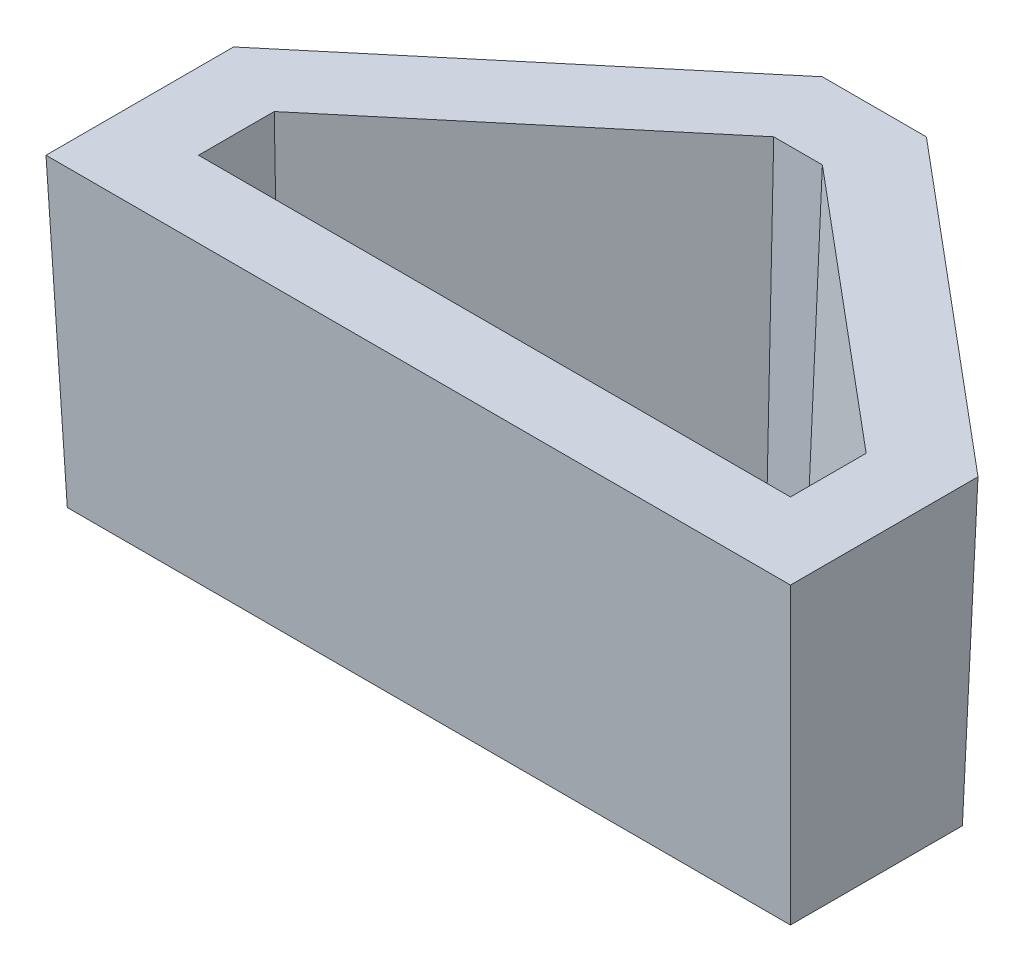
ISO-10303-21;
HEADER;
FILE_DESCRIPTION(('STEP AP214'),'2;1');
FILE_NAME('part.step','',(''),(''),'','','');
FILE_SCHEMA(('AUTOMOTIVE_DESIGN { 1 0 10303 214 1 1 1 1 }'));
ENDSEC;
DATA;
#1=APPLICATION_CONTEXT('core data for automotive mechanical design processes');
#2=APPLICATION_PROTOCOL_DEFINITION('international standard','automotive_design',2000,#1);
#3=PRODUCT_CONTEXT('',#1,'mechanical');
#4=PRODUCT('Part','Part','',(#3));
#5=PRODUCT_RELATED_PRODUCT_CATEGORY('part','',(#4));
#6=PRODUCT_DEFINITION_FORMATION('','',#4);
#7=PRODUCT_DEFINITION_CONTEXT('part definition',#1,'design');
#8=PRODUCT_DEFINITION('design','',#6,#7);
#9=PRODUCT_DEFINITION_SHAPE('','',#8);
#10=(LENGTH_UNIT() NAMED_UNIT(*) SI_UNIT(.MILLI.,.METRE.));
#11=(NAMED_UNIT(*) PLANE_ANGLE_UNIT() SI_UNIT($,.RADIAN.));
#12=(NAMED_UNIT(*) SI_UNIT($,.STERADIAN.) SOLID_ANGLE_UNIT());
#13=UNCERTAINTY_MEASURE_WITH_UNIT(LENGTH_MEASURE(1.E-05),#10,'distance_accuracy_value','');
#14=(GEOMETRIC_REPRESENTATION_CONTEXT(3) GLOBAL_UNCERTAINTY_ASSIGNED_CONTEXT((#13)) GLOBAL_UNIT_ASSIGNED_CONTEXT((#10,
#11,#12)) REPRESENTATION_CONTEXT('',''));
#15=CARTESIAN_POINT('',(0.,0.,0.));
#16=DIRECTION('',(0.,0.,1.));
#17=DIRECTION('',(1.,0.,0.));
#18=AXIS2_PLACEMENT_3D('',#15,#16,#17);
#19=CARTESIAN_POINT('',(40.6036008499512,0.,-63.2373203455384));
#20=DIRECTION('',(-0.642287141369066,-0.034899496702501,-0.765669153852932));
#21=DIRECTION('',(-0.766135863120447,0.,0.642678643834294));
#22=AXIS2_PLACEMENT_3D('',#19,#20,#21);
#23=PLANE('',#22);
#24=DIRECTION('',(-0.766135863120447,0.,0.642678643834294));
#25=VECTOR('',#24,1.);
#26=CARTESIAN_POINT('',(40.6036008499512,0.,-63.2373203455384));
#27=LINE('',#26,#25);
#28=CARTESIAN_POINT('',(40.6036008499512,0.,-63.2373203455384));
#29=VERTEX_POINT('',#28);
#30=CARTESIAN_POINT('',(-12.7,0.,-18.5232068902524));
#31=VERTEX_POINT('',#30);
#32=EDGE_CURVE('E173',#29,#31,#27,.T.);
#33=ORIENTED_EDGE('',*,*,#32,.F.);
#34=DIRECTION('',(-0.0126985433124823,0.999310246384854,-0.0348966827647472));
#35=VECTOR('',#34,1.);
#36=CARTESIAN_POINT('',(40.6063974282446,-0.220076372124338,-63.2296351092768));
#37=LINE('',#36,#35);
#38=CARTESIAN_POINT('',(41.249132107744,-50.8,-61.4633452553576));
#39=VERTEX_POINT('',#38);
#40=EDGE_CURVE('E11',#39,#29,#37,.T.);
#41=ORIENTED_EDGE('',*,*,#40,.F.);
#42=DIRECTION('',(-0.766135863120447,0.,0.642678643834294));
#43=VECTOR('',#42,1.);
#44=CARTESIAN_POINT('',(41.7436967551044,-50.8,-61.8782144086685));
#45=LINE('',#44,#43);
#46=CARTESIAN_POINT('',(-10.9260249098192,-50.8,-17.6958351203866));
#47=VERTEX_POINT('',#46);
#48=EDGE_CURVE('E226',#39,#47,#45,.T.);
#49=ORIENTED_EDGE('',*,*,#48,.T.);
#50=DIRECTION('',(-0.0348948745148471,0.999258464882715,-0.0162747685953412));
#51=VECTOR('',#50,1.);
#52=CARTESIAN_POINT('',(-12.660488163233,-1.13147096533441,-18.5047787970409));
#53=LINE('',#52,#51);
#54=EDGE_CURVE('E228',#47,#31,#53,.T.);
#55=ORIENTED_EDGE('',*,*,#54,.T.);
#56=EDGE_LOOP('',(#33,#41,#49,#55));
#57=FACE_BOUND('',#56,.T.);
#58=ADVANCED_FACE('F43',(#57),#23,.T.);
#59=CARTESIAN_POINT('',(57.9463991500488,0.,-63.2373203455384));
#60=DIRECTION('',(0.,-0.034899496702501,-0.999390827019096));
#61=DIRECTION('',(0.,0.999390827019096,-0.034899496702501));
#62=AXIS2_PLACEMENT_3D('',#59,#60,#61);
#63=PLANE('',#62);
#64=DIRECTION('',(-1.,0.,0.));
#65=VECTOR('',#64,1.);
#66=CARTESIAN_POINT('',(57.9463991500488,0.,-63.2373203455384));
#67=LINE('',#66,#65);
#68=CARTESIAN_POINT('',(57.9463991500488,0.,-63.2373203455384));
#69=VERTEX_POINT('',#68);
#70=EDGE_CURVE('E223',#69,#29,#67,.T.);
#71=ORIENTED_EDGE('',*,*,#70,.F.);
#72=DIRECTION('',(0.0126985433124823,0.999310246384854,-0.0348966827647472));
#73=VECTOR('',#72,1.);
#74=CARTESIAN_POINT('',(57.9351800359438,-0.882886753589432,-63.206489260729));
#75=LINE('',#74,#73);
#76=CARTESIAN_POINT('',(57.300867892256,-50.8,-61.4633452553576));
#77=VERTEX_POINT('',#76);
#78=EDGE_CURVE('E53',#77,#69,#75,.T.);
#79=ORIENTED_EDGE('',*,*,#78,.F.);
#80=DIRECTION('',(-1.,0.,0.));
#81=VECTOR('',#80,1.);
#82=CARTESIAN_POINT('',(57.9463991500488,-50.8,-61.4633452553576));
#83=LINE('',#82,#81);
#84=EDGE_CURVE('E232',#77,#39,#83,.T.);
#85=ORIENTED_EDGE('',*,*,#84,.T.);
#86=ORIENTED_EDGE('',*,*,#40,.T.);
#87=EDGE_LOOP('',(#71,#79,#85,#86));
#88=FACE_BOUND('',#87,.T.);
#89=ADVANCED_FACE('F277',(#88),#63,.T.);
#90=CARTESIAN_POINT('',(111.25,0.,-18.5232068902523));
#91=DIRECTION('',(0.642287141369066,-0.034899496702501,-0.765669153852932));
#92=DIRECTION('',(-0.766135863120447,0.,-0.642678643834294));
#93=AXIS2_PLACEMENT_3D('',#90,#91,#92);
#94=PLANE('',#93);
#95=DIRECTION('',(-0.766135863120447,0.,-0.642678643834294));
#96=VECTOR('',#95,1.);
#97=CARTESIAN_POINT('',(111.25,0.,-18.5232068902523));
#98=LINE('',#97,#96);
#99=CARTESIAN_POINT('',(111.25,0.,-18.5232068902523));
#100=VERTEX_POINT('',#99);
#101=EDGE_CURVE('E219',#100,#69,#98,.T.);
#102=ORIENTED_EDGE('',*,*,#101,.F.);
#103=DIRECTION('',(0.0348948745148471,0.999258464882715,-0.0162747685953412));
#104=VECTOR('',#103,1.);
#105=CARTESIAN_POINT('',(111.232268153221,-0.507773655527217,-18.5149368589912));
#106=LINE('',#105,#104);
#107=CARTESIAN_POINT('',(109.476024909819,-50.8,-17.6958351203866));
#108=VERTEX_POINT('',#107);
#109=EDGE_CURVE('E238',#108,#100,#106,.T.);
#110=ORIENTED_EDGE('',*,*,#109,.F.);
#111=DIRECTION('',(-0.766135863120447,0.,-0.642678643834294));
#112=VECTOR('',#111,1.);
#113=CARTESIAN_POINT('',(110.109904094847,-50.8,-17.1641009533825));
#114=LINE('',#113,#112);
#115=EDGE_CURVE('E249',#108,#77,#114,.T.);
#116=ORIENTED_EDGE('',*,*,#115,.T.);
#117=ORIENTED_EDGE('',*,*,#78,.T.);
#118=EDGE_LOOP('',(#102,#110,#116,#117));
#119=FACE_BOUND('',#118,.T.);
#120=ADVANCED_FACE('F285',(#119),#94,.T.);
#121=CARTESIAN_POINT('',(111.25,0.,12.7));
#122=DIRECTION('',(0.999390827019096,-0.034899496702501,0.));
#123=DIRECTION('',(0.034899496702501,0.999390827019096,0.));
#124=AXIS2_PLACEMENT_3D('',#121,#122,#123);
#125=PLANE('',#124);
#126=DIRECTION('',(0.,0.,-1.));
#127=VECTOR('',#126,1.);
#128=CARTESIAN_POINT('',(111.25,0.,12.7));
#129=LINE('',#128,#127);
#130=CARTESIAN_POINT('',(111.25,0.,12.7));
#131=VERTEX_POINT('',#130);
#132=EDGE_CURVE('E215',#131,#100,#129,.T.);
#133=ORIENTED_EDGE('',*,*,#132,.F.);
#134=DIRECTION('',(0.0348782627423747,0.998782765958718,0.0348782627423747));
#135=VECTOR('',#134,1.);
#136=CARTESIAN_POINT('',(111.099215666382,-4.31789836858764,12.5492156663818));
#137=LINE('',#136,#135);
#138=CARTESIAN_POINT('',(109.476024909819,-50.8,10.9260249098192));
#139=VERTEX_POINT('',#138);
#140=EDGE_CURVE('E235',#139,#131,#137,.T.);
#141=ORIENTED_EDGE('',*,*,#140,.F.);
#142=DIRECTION('',(0.,0.,-1.));
#143=VECTOR('',#142,1.);
#144=CARTESIAN_POINT('',(109.476024909819,-50.8,12.7));
#145=LINE('',#144,#143);
#146=EDGE_CURVE('E253',#139,#108,#145,.T.);
#147=ORIENTED_EDGE('',*,*,#146,.T.);
#148=ORIENTED_EDGE('',*,*,#109,.T.);
#149=EDGE_LOOP('',(#133,#141,#147,#148));
#150=FACE_BOUND('',#149,.T.);
#151=ADVANCED_FACE('F282',(#150),#125,.T.);
#152=CARTESIAN_POINT('',(-12.7,0.,12.7));
#153=DIRECTION('',(0.,-0.034899496702501,0.999390827019096));
#154=DIRECTION('',(0.,-0.999390827019096,-0.034899496702501));
#155=AXIS2_PLACEMENT_3D('',#152,#153,#154);
#156=PLANE('',#155);
#157=DIRECTION('',(1.,0.,0.));
#158=VECTOR('',#157,1.);
#159=CARTESIAN_POINT('',(-12.7,0.,12.7));
#160=LINE('',#159,#158);
#161=CARTESIAN_POINT('',(-12.7,0.,12.7));
#162=VERTEX_POINT('',#161);
#163=EDGE_CURVE('E211',#162,#131,#160,.T.);
#164=ORIENTED_EDGE('',*,*,#163,.F.);
#165=DIRECTION('',(-0.0348782627423747,0.998782765958718,0.0348782627423747));
#166=VECTOR('',#165,1.);
#167=CARTESIAN_POINT('',(-12.6620171807634,-1.08768563205724,12.6620171807634));
#168=LINE('',#167,#166);
#169=CARTESIAN_POINT('',(-10.9260249098192,-50.8,10.9260249098192));
#170=VERTEX_POINT('',#169);
#171=EDGE_CURVE('E231',#170,#162,#168,.T.);
#172=ORIENTED_EDGE('',*,*,#171,.F.);
#173=DIRECTION('',(1.,0.,0.));
#174=VECTOR('',#173,1.);
#175=CARTESIAN_POINT('',(-12.7,-50.8,10.9260249098192));
#176=LINE('',#175,#174);
#177=EDGE_CURVE('E256',#170,#139,#176,.T.);
#178=ORIENTED_EDGE('',*,*,#177,.T.);
#179=ORIENTED_EDGE('',*,*,#140,.T.);
#180=EDGE_LOOP('',(#164,#172,#178,#179));
#181=FACE_BOUND('',#180,.T.);
#182=ADVANCED_FACE('F284',(#181),#156,.T.);
#183=CARTESIAN_POINT('',(-12.7,0.,-18.5232068902524));
#184=DIRECTION('',(-0.999390827019096,-0.034899496702501,0.));
#185=DIRECTION('',(0.0348994967025011,-0.999390827019096,0.));
#186=AXIS2_PLACEMENT_3D('',#183,#184,#185);
#187=PLANE('',#186);
#188=DIRECTION('',(0.,0.,1.));
#189=VECTOR('',#188,1.);
#190=CARTESIAN_POINT('',(-12.7,0.,-18.5232068902524));
#191=LINE('',#190,#189);
#192=EDGE_CURVE('E207',#31,#162,#191,.T.);
#193=ORIENTED_EDGE('',*,*,#192,.F.);
#194=ORIENTED_EDGE('',*,*,#54,.F.);
#195=DIRECTION('',(0.,0.,1.));
#196=VECTOR('',#195,1.);
#197=CARTESIAN_POINT('',(-10.9260249098192,-50.8,-18.5232068902524));
#198=LINE('',#197,#196);
#199=EDGE_CURVE('E47',#47,#170,#198,.T.);
#200=ORIENTED_EDGE('',*,*,#199,.T.);
#201=ORIENTED_EDGE('',*,*,#171,.T.);
#202=EDGE_LOOP('',(#193,#194,#200,#201));
#203=FACE_BOUND('',#202,.T.);
#204=ADVANCED_FACE('F266',(#203),#187,.T.);
#205=CARTESIAN_POINT('',(0.,-50.8,0.));
#206=DIRECTION('',(0.,-1.,0.));
#207=DIRECTION('',(0.,0.,-1.));
#208=AXIS2_PLACEMENT_3D('',#205,#206,#207);
#209=PLANE('',#208);
#210=DIRECTION('',(0.,0.,1.));
#211=VECTOR('',#210,1.);
#212=CARTESIAN_POINT('',(1.77397509018079,-50.8,0.));
#213=LINE('',#212,#211);
#214=CARTESIAN_POINT('',(1.77397509018079,-50.8,-11.7726282301343));
#215=VERTEX_POINT('',#214);
#216=CARTESIAN_POINT('',(1.77397509018079,-50.8,-1.77397509018079));
#217=VERTEX_POINT('',#216);
#218=EDGE_CURVE('E169',#215,#217,#213,.T.);
#219=ORIENTED_EDGE('',*,*,#218,.T.);
#220=DIRECTION('',(1.,0.,0.));
#221=VECTOR('',#220,1.);
#222=CARTESIAN_POINT('',(0.,-50.8,-1.77397509018079));
#223=LINE('',#222,#221);
#224=CARTESIAN_POINT('',(96.7760249098192,-50.8,-1.77397509018079));
#225=VERTEX_POINT('',#224);
#226=EDGE_CURVE('E188',#217,#225,#223,.T.);
#227=ORIENTED_EDGE('',*,*,#226,.T.);
#228=DIRECTION('',(0.,0.,-1.));
#229=VECTOR('',#228,1.);
#230=CARTESIAN_POINT('',(96.7760249098192,-50.8,0.));
#231=LINE('',#230,#229);
#232=CARTESIAN_POINT('',(96.7760249098192,-50.8,-11.7726282301343));
#233=VERTEX_POINT('',#232);
#234=EDGE_CURVE('E61',#225,#233,#231,.T.);
#235=ORIENTED_EDGE('',*,*,#234,.T.);
#236=DIRECTION('',(-0.766135863120447,0.,-0.642678643834294));
#237=VECTOR('',#236,1.);
#238=CARTESIAN_POINT('',(45.7685634365552,-50.8,-54.5606084606246));
#239=LINE('',#238,#237);
#240=CARTESIAN_POINT('',(52.6794687422071,-50.8,-48.7633452553576));
#241=VERTEX_POINT('',#240);
#242=EDGE_CURVE('E196',#233,#241,#239,.T.);
#243=ORIENTED_EDGE('',*,*,#242,.T.);
#244=DIRECTION('',(-1.,0.,0.));
#245=VECTOR('',#244,1.);
#246=CARTESIAN_POINT('',(0.,-50.8,-48.7633452553576));
#247=LINE('',#246,#245);
#248=CARTESIAN_POINT('',(45.8705312577928,-50.8,-48.7633452553576));
#249=VERTEX_POINT('',#248);
#250=EDGE_CURVE('E192',#241,#249,#247,.T.);
#251=ORIENTED_EDGE('',*,*,#250,.T.);
#252=DIRECTION('',(-0.766135863120447,0.,0.642678643834294));
#253=VECTOR('',#252,1.);
#254=CARTESIAN_POINT('',(-5.06388147938542,-50.8,-6.03664248869751));
#255=LINE('',#254,#253);
#256=EDGE_CURVE('E176',#249,#215,#255,.T.);
#257=ORIENTED_EDGE('',*,*,#256,.T.);
#258=EDGE_LOOP('',(#219,#227,#235,#243,#251,#257));
#259=FACE_BOUND('',#258,.T.);
#260=ORIENTED_EDGE('',*,*,#48,.F.);
#261=ORIENTED_EDGE('',*,*,#84,.F.);
#262=ORIENTED_EDGE('',*,*,#115,.F.);
#263=ORIENTED_EDGE('',*,*,#146,.F.);
#264=ORIENTED_EDGE('',*,*,#177,.F.);
#265=ORIENTED_EDGE('',*,*,#199,.F.);
#266=EDGE_LOOP('',(#260,#261,#262,#263,#264,#265));
#267=FACE_BOUND('',#266,.T.);
#268=ADVANCED_FACE('F270',(#259,#267),#209,.T.);
#269=CARTESIAN_POINT('',(0.,0.,0.));
#270=DIRECTION('',(0.,1.,0.));
#271=DIRECTION('',(0.,0.,1.));
#272=AXIS2_PLACEMENT_3D('',#269,#270,#271);
#273=PLANE('',#272);
#274=DIRECTION('',(0.,0.,1.));
#275=VECTOR('',#274,1.);
#276=CARTESIAN_POINT('',(0.,0.,-12.6));
#277=LINE('',#276,#275);
#278=CARTESIAN_POINT('',(0.,0.,-12.6));
#279=VERTEX_POINT('',#278);
#280=CARTESIAN_POINT('',(0.,0.,0.));
#281=VERTEX_POINT('',#280);
#282=EDGE_CURVE('E69',#279,#281,#277,.T.);
#283=ORIENTED_EDGE('',*,*,#282,.F.);
#284=DIRECTION('',(-0.766135863120447,0.,0.642678643834294));
#285=VECTOR('',#284,1.);
#286=CARTESIAN_POINT('',(45.225,0.,-50.5373203455384));
#287=LINE('',#286,#285);
#288=CARTESIAN_POINT('',(45.225,0.,-50.5373203455384));
#289=VERTEX_POINT('',#288);
#290=EDGE_CURVE('E165',#289,#279,#287,.T.);
#291=ORIENTED_EDGE('',*,*,#290,.F.);
#292=DIRECTION('',(-1.,0.,0.));
#293=VECTOR('',#292,1.);
#294=CARTESIAN_POINT('',(53.325,0.,-50.5373203455384));
#295=LINE('',#294,#293);
#296=CARTESIAN_POINT('',(53.325,0.,-50.5373203455384));
#297=VERTEX_POINT('',#296);
#298=EDGE_CURVE('E158',#297,#289,#295,.T.);
#299=ORIENTED_EDGE('',*,*,#298,.F.);
#300=DIRECTION('',(-0.766135863120447,0.,-0.642678643834294));
#301=VECTOR('',#300,1.);
#302=CARTESIAN_POINT('',(98.55,0.,-12.6));
#303=LINE('',#302,#301);
#304=CARTESIAN_POINT('',(98.55,0.,-12.6));
#305=VERTEX_POINT('',#304);
#306=EDGE_CURVE('E154',#305,#297,#303,.T.);
#307=ORIENTED_EDGE('',*,*,#306,.F.);
#308=DIRECTION('',(0.,0.,-1.));
#309=VECTOR('',#308,1.);
#310=CARTESIAN_POINT('',(98.55,0.,0.));
#311=LINE('',#310,#309);
#312=CARTESIAN_POINT('',(98.55,0.,0.));
#313=VERTEX_POINT('',#312);
#314=EDGE_CURVE('E136',#313,#305,#311,.T.);
#315=ORIENTED_EDGE('',*,*,#314,.F.);
#316=DIRECTION('',(1.,0.,0.));
#317=VECTOR('',#316,1.);
#318=CARTESIAN_POINT('',(0.,0.,0.));
#319=LINE('',#318,#317);
#320=EDGE_CURVE('E146',#281,#313,#319,.T.);
#321=ORIENTED_EDGE('',*,*,#320,.F.);
#322=EDGE_LOOP('',(#283,#291,#299,#307,#315,#321));
#323=FACE_BOUND('',#322,.T.);
#324=ORIENTED_EDGE('',*,*,#32,.T.);
#325=ORIENTED_EDGE('',*,*,#192,.T.);
#326=ORIENTED_EDGE('',*,*,#163,.T.);
#327=ORIENTED_EDGE('',*,*,#132,.T.);
#328=ORIENTED_EDGE('',*,*,#101,.T.);
#329=ORIENTED_EDGE('',*,*,#70,.T.);
#330=EDGE_LOOP('',(#324,#325,#326,#327,#328,#329));
#331=FACE_BOUND('',#330,.T.);
#332=ADVANCED_FACE('F45',(#323,#331),#273,.T.);
#333=CARTESIAN_POINT('',(0.,0.,-12.6));
#334=DIRECTION('',(-0.999390827019096,-0.034899496702501,0.));
#335=DIRECTION('',(0.034899496702501,-0.999390827019096,0.));
#336=AXIS2_PLACEMENT_3D('',#333,#334,#335);
#337=PLANE('',#336);
#338=ORIENTED_EDGE('',*,*,#282,.T.);
#339=DIRECTION('',(-0.0348782627423747,0.998782765958718,0.0348782627423747));
#340=VECTOR('',#339,1.);
#341=CARTESIAN_POINT('',(0.0153278144702691,-0.438931177444165,-0.0153278144702715));
#342=LINE('',#341,#340);
#343=EDGE_CURVE('E143',#217,#281,#342,.T.);
#344=ORIENTED_EDGE('',*,*,#343,.F.);
#345=ORIENTED_EDGE('',*,*,#218,.F.);
#346=DIRECTION('',(-0.0348948745148471,0.999258464882715,-0.0162747685953412));
#347=VECTOR('',#346,1.);
#348=CARTESIAN_POINT('',(0.0335234916458982,-0.95998719769971,-12.5843648364801));
#349=LINE('',#348,#347);
#350=EDGE_CURVE('E170',#215,#279,#349,.T.);
#351=ORIENTED_EDGE('',*,*,#350,.T.);
#352=EDGE_LOOP('',(#338,#344,#345,#351));
#353=FACE_BOUND('',#352,.T.);
#354=ADVANCED_FACE('F323',(#353),#337,.F.);
#355=CARTESIAN_POINT('',(45.225,0.,-50.5373203455384));
#356=DIRECTION('',(-0.642287141369066,-0.034899496702501,-0.765669153852933));
#357=DIRECTION('',(-0.766135863120447,0.,0.642678643834294));
#358=AXIS2_PLACEMENT_3D('',#355,#356,#357);
#359=PLANE('',#358);
#360=ORIENTED_EDGE('',*,*,#290,.T.);
#361=ORIENTED_EDGE('',*,*,#350,.F.);
#362=ORIENTED_EDGE('',*,*,#256,.F.);
#363=DIRECTION('',(-0.0126985433124823,0.999310246384854,-0.0348966827647472));
#364=VECTOR('',#363,1.);
#365=CARTESIAN_POINT('',(45.2263061493183,-0.102787254015236,-50.5337309355342));
#366=LINE('',#365,#364);
#367=EDGE_CURVE('E174',#249,#289,#366,.T.);
#368=ORIENTED_EDGE('',*,*,#367,.T.);
#369=EDGE_LOOP('',(#360,#361,#362,#368));
#370=FACE_BOUND('',#369,.T.);
#371=ADVANCED_FACE('F329',(#370),#359,.F.);
#372=CARTESIAN_POINT('',(53.325,0.,-50.5373203455384));
#373=DIRECTION('',(0.,-0.034899496702501,-0.999390827019096));
#374=DIRECTION('',(0.,0.999390827019096,-0.034899496702501));
#375=AXIS2_PLACEMENT_3D('',#372,#373,#374);
#376=PLANE('',#375);
#377=ORIENTED_EDGE('',*,*,#298,.T.);
#378=ORIENTED_EDGE('',*,*,#367,.F.);
#379=ORIENTED_EDGE('',*,*,#250,.F.);
#380=DIRECTION('',(0.0126985433124823,0.999310246384854,-0.0348966827647472));
#381=VECTOR('',#380,1.);
#382=CARTESIAN_POINT('',(53.3154812352766,-0.74907797586659,-50.5111619662118));
#383=LINE('',#382,#381);
#384=EDGE_CURVE('E180',#241,#297,#383,.T.);
#385=ORIENTED_EDGE('',*,*,#384,.T.);
#386=EDGE_LOOP('',(#377,#378,#379,#385));
#387=FACE_BOUND('',#386,.T.);
#388=ADVANCED_FACE('F336',(#387),#376,.F.);
#389=CARTESIAN_POINT('',(98.55,0.,-12.6));
#390=DIRECTION('',(0.642287141369066,-0.034899496702501,-0.765669153852933));
#391=DIRECTION('',(-0.766135863120447,0.,-0.642678643834294));
#392=AXIS2_PLACEMENT_3D('',#389,#390,#391);
#393=PLANE('',#392);
#394=ORIENTED_EDGE('',*,*,#306,.T.);
#395=ORIENTED_EDGE('',*,*,#384,.F.);
#396=ORIENTED_EDGE('',*,*,#242,.F.);
#397=DIRECTION('',(0.0348948745148471,0.999258464882716,-0.0162747685953412));
#398=VECTOR('',#397,1.);
#399=CARTESIAN_POINT('',(98.5428443843006,-0.204910023564566,-12.5966626620303));
#400=LINE('',#399,#398);
#401=EDGE_CURVE('E142',#233,#305,#400,.T.);
#402=ORIENTED_EDGE('',*,*,#401,.T.);
#403=EDGE_LOOP('',(#394,#395,#396,#402));
#404=FACE_BOUND('',#403,.T.);
#405=ADVANCED_FACE('F343',(#404),#393,.F.);
#406=CARTESIAN_POINT('',(98.55,0.,0.));
#407=DIRECTION('',(0.999390827019096,-0.034899496702501,0.));
#408=DIRECTION('',(0.034899496702501,0.999390827019096,0.));
#409=AXIS2_PLACEMENT_3D('',#406,#407,#408);
#410=PLANE('',#409);
#411=ORIENTED_EDGE('',*,*,#314,.T.);
#412=ORIENTED_EDGE('',*,*,#401,.F.);
#413=ORIENTED_EDGE('',*,*,#234,.F.);
#414=DIRECTION('',(0.0348782627423747,0.998782765958718,0.0348782627423747));
#415=VECTOR('',#414,1.);
#416=CARTESIAN_POINT('',(98.4301145939647,-3.43306885215258,-0.119885406035319));
#417=LINE('',#416,#415);
#418=EDGE_CURVE('E132',#225,#313,#417,.T.);
#419=ORIENTED_EDGE('',*,*,#418,.T.);
#420=EDGE_LOOP('',(#411,#412,#413,#419));
#421=FACE_BOUND('',#420,.T.);
#422=ADVANCED_FACE('F134',(#421),#410,.F.);
#423=CARTESIAN_POINT('',(0.,0.,0.));
#424=DIRECTION('',(0.,-0.034899496702501,0.999390827019096));
#425=DIRECTION('',(0.,-0.999390827019096,-0.0348994967025011));
#426=AXIS2_PLACEMENT_3D('',#423,#424,#425);
#427=PLANE('',#426);
#428=ORIENTED_EDGE('',*,*,#320,.T.);
#429=ORIENTED_EDGE('',*,*,#418,.F.);
#430=ORIENTED_EDGE('',*,*,#226,.F.);
#431=ORIENTED_EDGE('',*,*,#343,.T.);
#432=EDGE_LOOP('',(#428,#429,#430,#431));
#433=FACE_BOUND('',#432,.T.);
#434=ADVANCED_FACE('F147',(#433),#427,.F.);
#435=CLOSED_SHELL('',(#58,#89,#120,#151,#182,#204,#268,#332,#354,#371,#388,#405,#422,#434));
#436=MANIFOLD_SOLID_BREP('B2',#435);
#437=ADVANCED_BREP_SHAPE_REPRESENTATION('',(#18,#436),#14);
#438=SHAPE_DEFINITION_REPRESENTATION(#9,#437);
ENDSEC;
END-ISO-10303-21;
